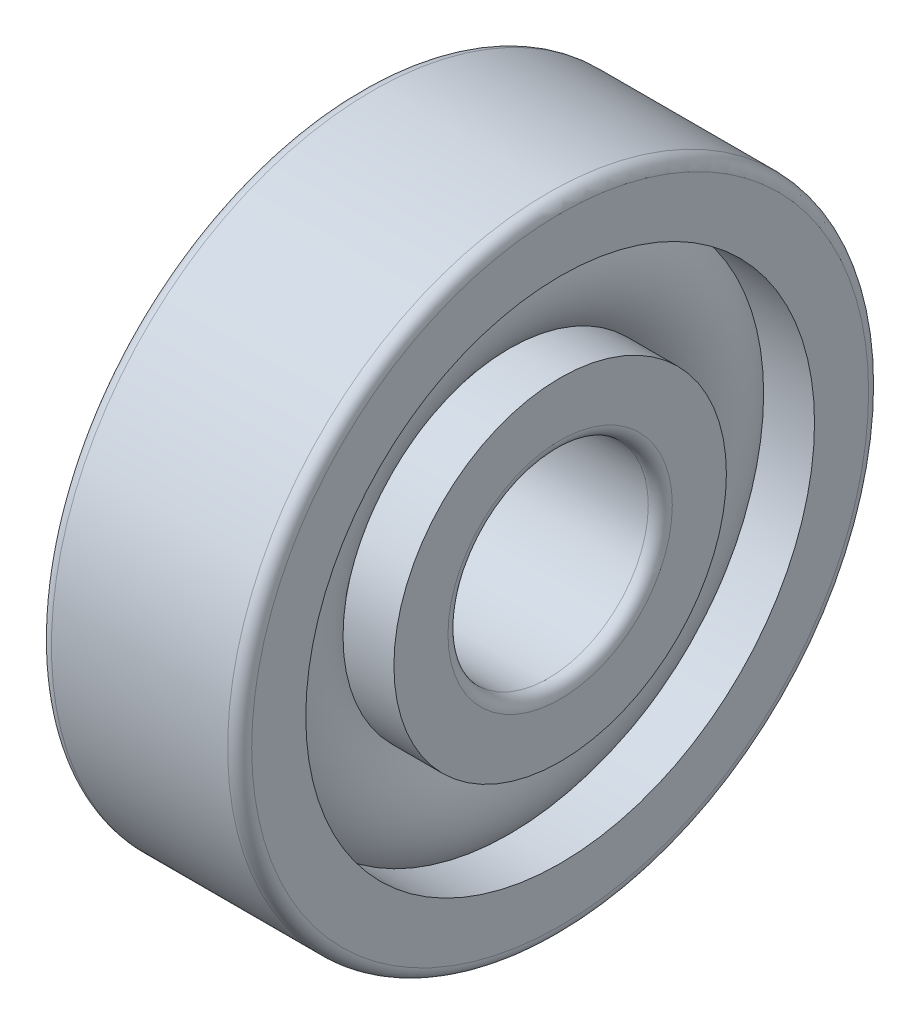
ISO-10303-21;
HEADER;
FILE_DESCRIPTION(('STEP AP214'),'2;1');
FILE_NAME('part.step','',(''),(''),'','','');
FILE_SCHEMA(('AUTOMOTIVE_DESIGN { 1 0 10303 214 1 1 1 1 }'));
ENDSEC;
DATA;
#1=APPLICATION_CONTEXT('core data for automotive mechanical design processes');
#2=APPLICATION_PROTOCOL_DEFINITION('international standard','automotive_design',2000,#1);
#3=PRODUCT_CONTEXT('',#1,'mechanical');
#4=PRODUCT('Part','Part','',(#3));
#5=PRODUCT_RELATED_PRODUCT_CATEGORY('part','',(#4));
#6=PRODUCT_DEFINITION_FORMATION('','',#4);
#7=PRODUCT_DEFINITION_CONTEXT('part definition',#1,'design');
#8=PRODUCT_DEFINITION('design','',#6,#7);
#9=PRODUCT_DEFINITION_SHAPE('','',#8);
#10=(LENGTH_UNIT() NAMED_UNIT(*) SI_UNIT(.MILLI.,.METRE.));
#11=(NAMED_UNIT(*) PLANE_ANGLE_UNIT() SI_UNIT($,.RADIAN.));
#12=(NAMED_UNIT(*) SI_UNIT($,.STERADIAN.) SOLID_ANGLE_UNIT());
#13=UNCERTAINTY_MEASURE_WITH_UNIT(LENGTH_MEASURE(1.E-05),#10,'distance_accuracy_value','');
#14=(GEOMETRIC_REPRESENTATION_CONTEXT(3) GLOBAL_UNCERTAINTY_ASSIGNED_CONTEXT((#13)) GLOBAL_UNIT_ASSIGNED_CONTEXT((#10,
#11,#12)) REPRESENTATION_CONTEXT('',''));
#15=CARTESIAN_POINT('',(0.,0.,0.));
#16=DIRECTION('',(0.,0.,1.));
#17=DIRECTION('',(1.,0.,0.));
#18=AXIS2_PLACEMENT_3D('',#15,#16,#17);
#19=CARTESIAN_POINT('',(-20.6375,0.,0.));
#20=DIRECTION('',(1.,0.,0.));
#21=DIRECTION('',(0.,0.,-1.));
#22=AXIS2_PLACEMENT_3D('',#19,#20,#21);
#23=CYLINDRICAL_SURFACE('',#22,2.5);
#24=CARTESIAN_POINT('',(2.2,0.,0.));
#25=DIRECTION('',(1.,0.,0.));
#26=DIRECTION('',(0.,0.,-1.));
#27=AXIS2_PLACEMENT_3D('',#24,#25,#26);
#28=CIRCLE('',#27,2.5);
#29=CARTESIAN_POINT('',(2.2,0.,-2.5));
#30=VERTEX_POINT('',#29);
#31=EDGE_CURVE('E76',#30,#30,#28,.F.);
#32=ORIENTED_EDGE('',*,*,#31,.F.);
#33=EDGE_LOOP('',(#32));
#34=FACE_BOUND('',#33,.T.);
#35=CARTESIAN_POINT('',(-2.2,0.,0.));
#36=DIRECTION('',(1.,0.,0.));
#37=DIRECTION('',(0.,0.,-1.));
#38=AXIS2_PLACEMENT_3D('',#35,#36,#37);
#39=CIRCLE('',#38,2.5);
#40=CARTESIAN_POINT('',(-2.2,0.,-2.5));
#41=VERTEX_POINT('',#40);
#42=EDGE_CURVE('E139',#41,#41,#39,.T.);
#43=ORIENTED_EDGE('',*,*,#42,.F.);
#44=EDGE_LOOP('',(#43));
#45=FACE_BOUND('',#44,.T.);
#46=ADVANCED_FACE('F25',(#34,#45),#23,.F.);
#47=CARTESIAN_POINT('',(-2.2,0.,0.));
#48=DIRECTION('',(1.,0.,0.));
#49=DIRECTION('',(0.,0.,-1.));
#50=AXIS2_PLACEMENT_3D('',#47,#48,#49);
#51=TOROIDAL_SURFACE('',#50,2.8,0.3);
#52=ORIENTED_EDGE('',*,*,#42,.T.);
#53=EDGE_LOOP('',(#52));
#54=FACE_BOUND('',#53,.T.);
#55=CARTESIAN_POINT('',(-2.5,0.,0.));
#56=DIRECTION('',(-1.,0.,0.));
#57=DIRECTION('',(0.,0.,-1.));
#58=AXIS2_PLACEMENT_3D('',#55,#56,#57);
#59=CIRCLE('',#58,2.8);
#60=CARTESIAN_POINT('',(-2.5,0.,2.8));
#61=VERTEX_POINT('',#60);
#62=CARTESIAN_POINT('',(-2.5,0.,-2.8));
#63=VERTEX_POINT('',#62);
#64=EDGE_CURVE('E66',#61,#63,#59,.F.);
#65=ORIENTED_EDGE('',*,*,#64,.F.);
#66=CARTESIAN_POINT('',(-2.5,0.,0.));
#67=DIRECTION('',(-1.,0.,0.));
#68=DIRECTION('',(0.,0.,1.));
#69=AXIS2_PLACEMENT_3D('',#66,#67,#68);
#70=CIRCLE('',#69,2.8);
#71=EDGE_CURVE('E64',#63,#61,#70,.F.);
#72=ORIENTED_EDGE('',*,*,#71,.F.);
#73=EDGE_LOOP('',(#65,#72));
#74=FACE_BOUND('',#73,.T.);
#75=ADVANCED_FACE('F68',(#54,#74),#51,.T.);
#76=CARTESIAN_POINT('',(2.2,0.,0.));
#77=DIRECTION('',(1.,0.,0.));
#78=DIRECTION('',(0.,0.,-1.));
#79=AXIS2_PLACEMENT_3D('',#76,#77,#78);
#80=TOROIDAL_SURFACE('',#79,2.8,0.3);
#81=CARTESIAN_POINT('',(2.5,0.,0.));
#82=DIRECTION('',(1.,0.,0.));
#83=DIRECTION('',(0.,0.,-1.));
#84=AXIS2_PLACEMENT_3D('',#81,#82,#83);
#85=CIRCLE('',#84,2.8);
#86=CARTESIAN_POINT('',(2.5,0.,2.8));
#87=VERTEX_POINT('',#86);
#88=CARTESIAN_POINT('',(2.5,0.,-2.8));
#89=VERTEX_POINT('',#88);
#90=EDGE_CURVE('E71',#87,#89,#85,.F.);
#91=ORIENTED_EDGE('',*,*,#90,.F.);
#92=CARTESIAN_POINT('',(2.5,0.,0.));
#93=DIRECTION('',(1.,0.,0.));
#94=DIRECTION('',(0.,0.,1.));
#95=AXIS2_PLACEMENT_3D('',#92,#93,#94);
#96=CIRCLE('',#95,2.8);
#97=EDGE_CURVE('E115',#89,#87,#96,.F.);
#98=ORIENTED_EDGE('',*,*,#97,.F.);
#99=EDGE_LOOP('',(#91,#98));
#100=FACE_BOUND('',#99,.T.);
#101=ORIENTED_EDGE('',*,*,#31,.T.);
#102=EDGE_LOOP('',(#101));
#103=FACE_BOUND('',#102,.T.);
#104=ADVANCED_FACE('F96',(#100,#103),#80,.T.);
#105=CARTESIAN_POINT('',(-2.5,4.15,0.));
#106=DIRECTION('',(-1.,0.,0.));
#107=DIRECTION('',(0.,0.,1.));
#108=AXIS2_PLACEMENT_3D('',#105,#106,#107);
#109=PLANE('',#108);
#110=CARTESIAN_POINT('',(-2.5,0.,0.));
#111=DIRECTION('',(1.,0.,0.));
#112=DIRECTION('',(0.,0.,-1.));
#113=AXIS2_PLACEMENT_3D('',#110,#111,#112);
#114=CIRCLE('',#113,4.15);
#115=CARTESIAN_POINT('',(-2.5,0.,-4.15));
#116=VERTEX_POINT('',#115);
#117=EDGE_CURVE('E154',#116,#116,#114,.T.);
#118=ORIENTED_EDGE('',*,*,#117,.F.);
#119=EDGE_LOOP('',(#118));
#120=FACE_BOUND('',#119,.T.);
#121=ORIENTED_EDGE('',*,*,#71,.T.);
#122=ORIENTED_EDGE('',*,*,#64,.T.);
#123=EDGE_LOOP('',(#121,#122));
#124=FACE_BOUND('',#123,.T.);
#125=ADVANCED_FACE('F75',(#120,#124),#109,.T.);
#126=CARTESIAN_POINT('',(2.5,2.8,0.));
#127=DIRECTION('',(1.,0.,0.));
#128=DIRECTION('',(0.,0.,-1.));
#129=AXIS2_PLACEMENT_3D('',#126,#127,#128);
#130=PLANE('',#129);
#131=ORIENTED_EDGE('',*,*,#90,.T.);
#132=ORIENTED_EDGE('',*,*,#97,.T.);
#133=EDGE_LOOP('',(#131,#132));
#134=FACE_BOUND('',#133,.T.);
#135=CARTESIAN_POINT('',(2.5,0.,0.));
#136=DIRECTION('',(1.,0.,0.));
#137=DIRECTION('',(0.,0.,-1.));
#138=AXIS2_PLACEMENT_3D('',#135,#136,#137);
#139=CIRCLE('',#138,4.15);
#140=CARTESIAN_POINT('',(2.5,0.,-4.15));
#141=VERTEX_POINT('',#140);
#142=EDGE_CURVE('E150',#141,#141,#139,.F.);
#143=ORIENTED_EDGE('',*,*,#142,.F.);
#144=EDGE_LOOP('',(#143));
#145=FACE_BOUND('',#144,.T.);
#146=ADVANCED_FACE('F95',(#134,#145),#130,.T.);
#147=CARTESIAN_POINT('',(-20.6375,0.,0.));
#148=DIRECTION('',(1.,0.,0.));
#149=DIRECTION('',(0.,0.,-1.));
#150=AXIS2_PLACEMENT_3D('',#147,#148,#149);
#151=CYLINDRICAL_SURFACE('',#150,4.15);
#152=ORIENTED_EDGE('',*,*,#117,.T.);
#153=EDGE_LOOP('',(#152));
#154=FACE_BOUND('',#153,.T.);
#155=CARTESIAN_POINT('',(-1.22983738762489,0.,0.));
#156=DIRECTION('',(-1.,0.,0.));
#157=DIRECTION('',(0.,0.,1.));
#158=AXIS2_PLACEMENT_3D('',#155,#156,#157);
#159=CIRCLE('',#158,4.15);
#160=CARTESIAN_POINT('',(-1.22983738762489,0.,4.15));
#161=VERTEX_POINT('',#160);
#162=EDGE_CURVE('E153',#161,#161,#159,.F.);
#163=ORIENTED_EDGE('',*,*,#162,.F.);
#164=EDGE_LOOP('',(#163));
#165=FACE_BOUND('',#164,.T.);
#166=ADVANCED_FACE('F288',(#154,#165),#151,.T.);
#167=CARTESIAN_POINT('',(-20.6375,0.,0.));
#168=DIRECTION('',(1.,0.,0.));
#169=DIRECTION('',(0.,0.,-1.));
#170=AXIS2_PLACEMENT_3D('',#167,#168,#169);
#171=CYLINDRICAL_SURFACE('',#170,4.15);
#172=CARTESIAN_POINT('',(1.22983738762488,0.,0.));
#173=DIRECTION('',(-1.,0.,0.));
#174=DIRECTION('',(0.,0.,1.));
#175=AXIS2_PLACEMENT_3D('',#172,#173,#174);
#176=CIRCLE('',#175,4.15);
#177=CARTESIAN_POINT('',(1.22983738762488,0.,4.15));
#178=VERTEX_POINT('',#177);
#179=EDGE_CURVE('E272',#178,#178,#176,.T.);
#180=ORIENTED_EDGE('',*,*,#179,.F.);
#181=EDGE_LOOP('',(#180));
#182=FACE_BOUND('',#181,.T.);
#183=ORIENTED_EDGE('',*,*,#142,.T.);
#184=EDGE_LOOP('',(#183));
#185=FACE_BOUND('',#184,.T.);
#186=ADVANCED_FACE('F267',(#182,#185),#171,.T.);
#187=CARTESIAN_POINT('',(0.,0.,0.));
#188=DIRECTION('',(-1.,0.,0.));
#189=DIRECTION('',(0.,0.,1.));
#190=AXIS2_PLACEMENT_3D('',#187,#188,#189);
#191=TOROIDAL_SURFACE('',#190,5.25,1.65);
#192=CARTESIAN_POINT('',(-1.22983738762488,0.,0.));
#193=DIRECTION('',(1.,0.,0.));
#194=DIRECTION('',(0.,0.,-1.));
#195=AXIS2_PLACEMENT_3D('',#192,#193,#194);
#196=CIRCLE('',#195,6.35);
#197=CARTESIAN_POINT('',(-1.22983738762488,0.,-6.35));
#198=VERTEX_POINT('',#197);
#199=EDGE_CURVE('E271',#198,#198,#196,.F.);
#200=ORIENTED_EDGE('',*,*,#199,.T.);
#201=EDGE_LOOP('',(#200));
#202=FACE_BOUND('',#201,.T.);
#203=ORIENTED_EDGE('',*,*,#162,.T.);
#204=EDGE_LOOP('',(#203));
#205=FACE_BOUND('',#204,.T.);
#206=ADVANCED_FACE('F262',(#202,#205),#191,.T.);
#207=CARTESIAN_POINT('',(0.,0.,0.));
#208=DIRECTION('',(-1.,0.,0.));
#209=DIRECTION('',(0.,0.,1.));
#210=AXIS2_PLACEMENT_3D('',#207,#208,#209);
#211=TOROIDAL_SURFACE('',#210,5.25,1.65);
#212=ORIENTED_EDGE('',*,*,#179,.T.);
#213=EDGE_LOOP('',(#212));
#214=FACE_BOUND('',#213,.T.);
#215=CARTESIAN_POINT('',(1.22983738762488,0.,0.));
#216=DIRECTION('',(1.,0.,0.));
#217=DIRECTION('',(0.,0.,-1.));
#218=AXIS2_PLACEMENT_3D('',#215,#216,#217);
#219=CIRCLE('',#218,6.35);
#220=CARTESIAN_POINT('',(1.22983738762488,0.,-6.35));
#221=VERTEX_POINT('',#220);
#222=EDGE_CURVE('E149',#221,#221,#219,.T.);
#223=ORIENTED_EDGE('',*,*,#222,.T.);
#224=EDGE_LOOP('',(#223));
#225=FACE_BOUND('',#224,.T.);
#226=ADVANCED_FACE('F257',(#214,#225),#211,.T.);
#227=CARTESIAN_POINT('',(-20.6375,0.,0.));
#228=DIRECTION('',(1.,0.,0.));
#229=DIRECTION('',(0.,0.,-1.));
#230=AXIS2_PLACEMENT_3D('',#227,#228,#229);
#231=CYLINDRICAL_SURFACE('',#230,6.35);
#232=ORIENTED_EDGE('',*,*,#199,.F.);
#233=EDGE_LOOP('',(#232));
#234=FACE_BOUND('',#233,.T.);
#235=CARTESIAN_POINT('',(-2.5,0.,0.));
#236=DIRECTION('',(1.,0.,0.));
#237=DIRECTION('',(0.,0.,-1.));
#238=AXIS2_PLACEMENT_3D('',#235,#236,#237);
#239=CIRCLE('',#238,6.35);
#240=CARTESIAN_POINT('',(-2.5,0.,-6.35));
#241=VERTEX_POINT('',#240);
#242=EDGE_CURVE('E146',#241,#241,#239,.T.);
#243=ORIENTED_EDGE('',*,*,#242,.F.);
#244=EDGE_LOOP('',(#243));
#245=FACE_BOUND('',#244,.T.);
#246=ADVANCED_FACE('F261',(#234,#245),#231,.F.);
#247=CARTESIAN_POINT('',(-20.6375,0.,0.));
#248=DIRECTION('',(1.,0.,0.));
#249=DIRECTION('',(0.,0.,-1.));
#250=AXIS2_PLACEMENT_3D('',#247,#248,#249);
#251=CYLINDRICAL_SURFACE('',#250,6.35);
#252=CARTESIAN_POINT('',(2.5,0.,0.));
#253=DIRECTION('',(1.,0.,0.));
#254=DIRECTION('',(0.,0.,-1.));
#255=AXIS2_PLACEMENT_3D('',#252,#253,#254);
#256=CIRCLE('',#255,6.35);
#257=CARTESIAN_POINT('',(2.5,0.,-6.35));
#258=VERTEX_POINT('',#257);
#259=EDGE_CURVE('E142',#258,#258,#256,.F.);
#260=ORIENTED_EDGE('',*,*,#259,.F.);
#261=EDGE_LOOP('',(#260));
#262=FACE_BOUND('',#261,.T.);
#263=ORIENTED_EDGE('',*,*,#222,.F.);
#264=EDGE_LOOP('',(#263));
#265=FACE_BOUND('',#264,.T.);
#266=ADVANCED_FACE('F344',(#262,#265),#251,.F.);
#267=CARTESIAN_POINT('',(-2.5,6.35,0.));
#268=DIRECTION('',(-1.,0.,0.));
#269=DIRECTION('',(0.,0.,1.));
#270=AXIS2_PLACEMENT_3D('',#267,#268,#269);
#271=PLANE('',#270);
#272=CARTESIAN_POINT('',(-2.5,0.,0.));
#273=DIRECTION('',(1.,0.,0.));
#274=DIRECTION('',(0.,0.,-1.));
#275=AXIS2_PLACEMENT_3D('',#272,#273,#274);
#276=CIRCLE('',#275,7.70000000000001);
#277=CARTESIAN_POINT('',(-2.5,0.,-7.70000000000001));
#278=VERTEX_POINT('',#277);
#279=CARTESIAN_POINT('',(-2.5,0.,7.70000000000001));
#280=VERTEX_POINT('',#279);
#281=EDGE_CURVE('E225',#278,#280,#276,.T.);
#282=ORIENTED_EDGE('',*,*,#281,.F.);
#283=CARTESIAN_POINT('',(-2.5,0.,0.));
#284=DIRECTION('',(1.,0.,0.));
#285=DIRECTION('',(0.,0.,1.));
#286=AXIS2_PLACEMENT_3D('',#283,#284,#285);
#287=CIRCLE('',#286,7.70000000000001);
#288=EDGE_CURVE('E145',#280,#278,#287,.T.);
#289=ORIENTED_EDGE('',*,*,#288,.F.);
#290=EDGE_LOOP('',(#282,#289));
#291=FACE_BOUND('',#290,.T.);
#292=ORIENTED_EDGE('',*,*,#242,.T.);
#293=EDGE_LOOP('',(#292));
#294=FACE_BOUND('',#293,.T.);
#295=ADVANCED_FACE('F201',(#291,#294),#271,.T.);
#296=CARTESIAN_POINT('',(2.5,7.70000000000001,0.));
#297=DIRECTION('',(1.,0.,0.));
#298=DIRECTION('',(0.,0.,-1.));
#299=AXIS2_PLACEMENT_3D('',#296,#297,#298);
#300=PLANE('',#299);
#301=ORIENTED_EDGE('',*,*,#259,.T.);
#302=EDGE_LOOP('',(#301));
#303=FACE_BOUND('',#302,.T.);
#304=CARTESIAN_POINT('',(2.5,0.,0.));
#305=DIRECTION('',(-1.,0.,0.));
#306=DIRECTION('',(0.,0.,1.));
#307=AXIS2_PLACEMENT_3D('',#304,#305,#306);
#308=CIRCLE('',#307,7.70000000000001);
#309=CARTESIAN_POINT('',(2.5,0.,7.70000000000001));
#310=VERTEX_POINT('',#309);
#311=CARTESIAN_POINT('',(2.5,0.,-7.70000000000001));
#312=VERTEX_POINT('',#311);
#313=EDGE_CURVE('E188',#310,#312,#308,.T.);
#314=ORIENTED_EDGE('',*,*,#313,.F.);
#315=CARTESIAN_POINT('',(2.5,0.,0.));
#316=DIRECTION('',(-1.,0.,0.));
#317=DIRECTION('',(0.,0.,-1.));
#318=AXIS2_PLACEMENT_3D('',#315,#316,#317);
#319=CIRCLE('',#318,7.70000000000001);
#320=EDGE_CURVE('E43',#312,#310,#319,.T.);
#321=ORIENTED_EDGE('',*,*,#320,.F.);
#322=EDGE_LOOP('',(#314,#321));
#323=FACE_BOUND('',#322,.T.);
#324=ADVANCED_FACE('F192',(#303,#323),#300,.T.);
#325=CARTESIAN_POINT('',(-2.2,0.,0.));
#326=DIRECTION('',(1.,0.,0.));
#327=DIRECTION('',(0.,0.,-1.));
#328=AXIS2_PLACEMENT_3D('',#325,#326,#327);
#329=TOROIDAL_SURFACE('',#328,7.70000000000001,0.299999999999999);
#330=CARTESIAN_POINT('',(-2.2,0.,0.));
#331=DIRECTION('',(1.,0.,0.));
#332=DIRECTION('',(0.,0.,-1.));
#333=AXIS2_PLACEMENT_3D('',#330,#331,#332);
#334=CIRCLE('',#333,8.00000000000001);
#335=CARTESIAN_POINT('',(-2.2,0.,-8.00000000000001));
#336=VERTEX_POINT('',#335);
#337=EDGE_CURVE('E35',#336,#336,#334,.T.);
#338=ORIENTED_EDGE('',*,*,#337,.F.);
#339=EDGE_LOOP('',(#338));
#340=FACE_BOUND('',#339,.T.);
#341=ORIENTED_EDGE('',*,*,#281,.T.);
#342=ORIENTED_EDGE('',*,*,#288,.T.);
#343=EDGE_LOOP('',(#341,#342));
#344=FACE_BOUND('',#343,.T.);
#345=ADVANCED_FACE('F177',(#340,#344),#329,.T.);
#346=CARTESIAN_POINT('',(2.2,0.,0.));
#347=DIRECTION('',(1.,0.,0.));
#348=DIRECTION('',(0.,0.,-1.));
#349=AXIS2_PLACEMENT_3D('',#346,#347,#348);
#350=TOROIDAL_SURFACE('',#349,7.70000000000001,0.299999999999999);
#351=ORIENTED_EDGE('',*,*,#320,.T.);
#352=ORIENTED_EDGE('',*,*,#313,.T.);
#353=EDGE_LOOP('',(#351,#352));
#354=FACE_BOUND('',#353,.T.);
#355=CARTESIAN_POINT('',(2.2,0.,0.));
#356=DIRECTION('',(1.,0.,0.));
#357=DIRECTION('',(0.,0.,-1.));
#358=AXIS2_PLACEMENT_3D('',#355,#356,#357);
#359=CIRCLE('',#358,8.00000000000001);
#360=CARTESIAN_POINT('',(2.2,0.,-8.00000000000001));
#361=VERTEX_POINT('',#360);
#362=EDGE_CURVE('E13',#361,#361,#359,.F.);
#363=ORIENTED_EDGE('',*,*,#362,.F.);
#364=EDGE_LOOP('',(#363));
#365=FACE_BOUND('',#364,.T.);
#366=ADVANCED_FACE('F165',(#354,#365),#350,.T.);
#367=CARTESIAN_POINT('',(-20.6375,0.,0.));
#368=DIRECTION('',(1.,0.,0.));
#369=DIRECTION('',(0.,0.,-1.));
#370=AXIS2_PLACEMENT_3D('',#367,#368,#369);
#371=CYLINDRICAL_SURFACE('',#370,8.00000000000001);
#372=ORIENTED_EDGE('',*,*,#362,.T.);
#373=EDGE_LOOP('',(#372));
#374=FACE_BOUND('',#373,.T.);
#375=ORIENTED_EDGE('',*,*,#337,.T.);
#376=EDGE_LOOP('',(#375));
#377=FACE_BOUND('',#376,.T.);
#378=ADVANCED_FACE('F176',(#374,#377),#371,.T.);
#379=CLOSED_SHELL('',(#46,#75,#104,#125,#146,#166,#186,#206,#226,#246,#266,#295,#324,#345,#366,#378));
#380=MANIFOLD_SOLID_BREP('B1',#379);
#381=ADVANCED_BREP_SHAPE_REPRESENTATION('',(#18,#380),#14);
#382=SHAPE_DEFINITION_REPRESENTATION(#9,#381);
ENDSEC;
END-ISO-10303-21;
